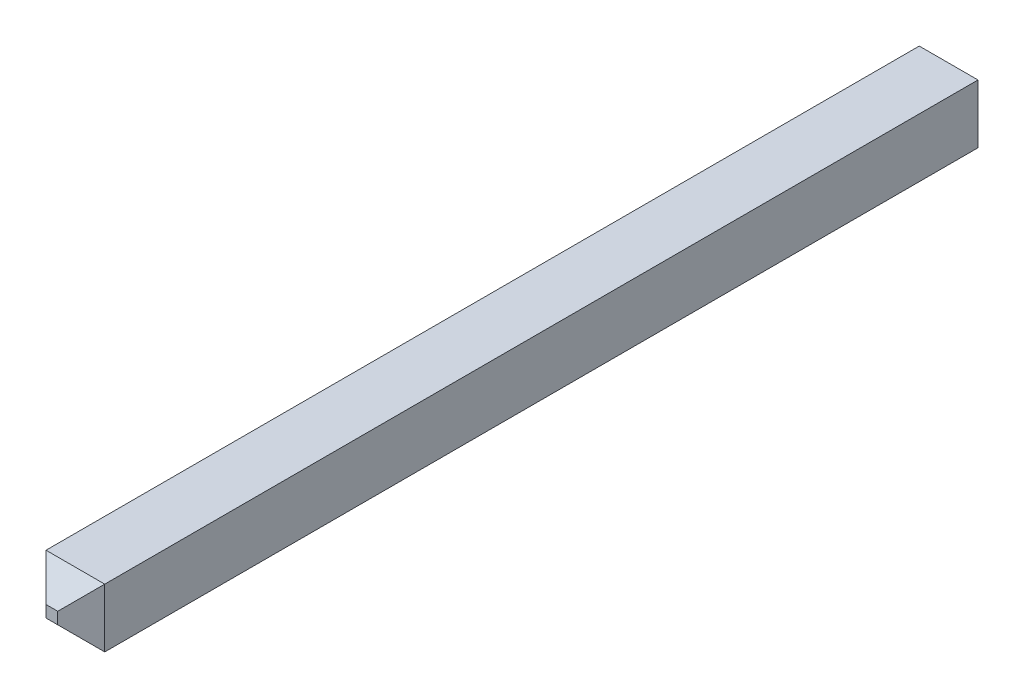
ISO-10303-21;
HEADER;
FILE_DESCRIPTION(('STEP AP214'),'2;1');
FILE_NAME('part.step','',(''),(''),'','','');
FILE_SCHEMA(('AUTOMOTIVE_DESIGN { 1 0 10303 214 1 1 1 1 }'));
ENDSEC;
DATA;
#1=APPLICATION_CONTEXT('core data for automotive mechanical design processes');
#2=APPLICATION_PROTOCOL_DEFINITION('international standard','automotive_design',2000,#1);
#3=PRODUCT_CONTEXT('',#1,'mechanical');
#4=PRODUCT('Part','Part','',(#3));
#5=PRODUCT_RELATED_PRODUCT_CATEGORY('part','',(#4));
#6=PRODUCT_DEFINITION_FORMATION('','',#4);
#7=PRODUCT_DEFINITION_CONTEXT('part definition',#1,'design');
#8=PRODUCT_DEFINITION('design','',#6,#7);
#9=PRODUCT_DEFINITION_SHAPE('','',#8);
#10=(LENGTH_UNIT() NAMED_UNIT(*) SI_UNIT(.MILLI.,.METRE.));
#11=(NAMED_UNIT(*) PLANE_ANGLE_UNIT() SI_UNIT($,.RADIAN.));
#12=(NAMED_UNIT(*) SI_UNIT($,.STERADIAN.) SOLID_ANGLE_UNIT());
#13=UNCERTAINTY_MEASURE_WITH_UNIT(LENGTH_MEASURE(1.E-05),#10,'distance_accuracy_value','');
#14=(GEOMETRIC_REPRESENTATION_CONTEXT(3) GLOBAL_UNCERTAINTY_ASSIGNED_CONTEXT((#13)) GLOBAL_UNIT_ASSIGNED_CONTEXT((#10,
#11,#12)) REPRESENTATION_CONTEXT('',''));
#15=CARTESIAN_POINT('',(0.,0.,0.));
#16=DIRECTION('',(0.,0.,1.));
#17=DIRECTION('',(1.,0.,0.));
#18=AXIS2_PLACEMENT_3D('',#15,#16,#17);
#19=CARTESIAN_POINT('',(0.631975872170932,-0.915257438330513,0.400189763779528));
#20=DIRECTION('',(0.,-0.707106781186544,-0.707106781186551));
#21=DIRECTION('',(0.,0.707106781186551,-0.707106781186544));
#22=AXIS2_PLACEMENT_3D('',#19,#20,#21);
#23=PLANE('',#22);
#24=DIRECTION('',(-1.,0.,0.));
#25=VECTOR('',#24,1.);
#26=CARTESIAN_POINT('',(0.612487683194554,-0.914666887149411,0.399599212598425));
#27=LINE('',#26,#25);
#28=CARTESIAN_POINT('',(0.612782958785105,-0.914666887149411,0.399599212598425));
#29=VERTEX_POINT('',#28);
#30=CARTESIAN_POINT('',(0.618688470596129,-0.914666887149411,0.399599212598425));
#31=VERTEX_POINT('',#30);
#32=EDGE_CURVE('E80',#29,#31,#27,.F.);
#33=ORIENTED_EDGE('',*,*,#32,.T.);
#34=DIRECTION('',(-0.577350269189636,-0.57735026918961,0.577350269189631));
#35=VECTOR('',#34,1.);
#36=CARTESIAN_POINT('',(0.630499494218177,-0.902855863527364,0.387788188976378));
#37=LINE('',#36,#35);
#38=CARTESIAN_POINT('',(0.630499494218177,-0.902855863527364,0.387788188976378));
#39=VERTEX_POINT('',#38);
#40=EDGE_CURVE('E20',#39,#31,#37,.T.);
#41=ORIENTED_EDGE('',*,*,#40,.F.);
#42=DIRECTION('',(1.,0.,0.));
#43=VECTOR('',#42,1.);
#44=CARTESIAN_POINT('',(0.599495557210302,-0.902855863527364,0.387788188976378));
#45=LINE('',#44,#43);
#46=CARTESIAN_POINT('',(0.600971935163058,-0.902855863527364,0.387788188976378));
#47=VERTEX_POINT('',#46);
#48=EDGE_CURVE('E107',#39,#47,#45,.F.);
#49=ORIENTED_EDGE('',*,*,#48,.T.);
#50=DIRECTION('',(-0.577350269189628,0.577350269189628,-0.577350269189622));
#51=VECTOR('',#50,1.);
#52=CARTESIAN_POINT('',(0.612782958785105,-0.914666887149411,0.399599212598425));
#53=LINE('',#52,#51);
#54=EDGE_CURVE('E86',#29,#47,#53,.T.);
#55=ORIENTED_EDGE('',*,*,#54,.F.);
#56=EDGE_LOOP('',(#33,#41,#49,#55));
#57=FACE_BOUND('',#56,.T.);
#58=ADVANCED_FACE('F17',(#57),#23,.F.);
#59=CARTESIAN_POINT('',(0.599495557210302,-0.902265312346261,-0.0505976377952755));
#60=DIRECTION('',(0.,0.707106781186552,-0.707106781186543));
#61=DIRECTION('',(0.,0.707106781186543,0.707106781186552));
#62=AXIS2_PLACEMENT_3D('',#59,#60,#61);
#63=PLANE('',#62);
#64=DIRECTION('',(-0.577350269189632,-0.577350269189605,-0.57735026918964));
#65=VECTOR('',#64,1.);
#66=CARTESIAN_POINT('',(0.630499494218177,-0.902855863527364,-0.0511881889763777));
#67=LINE('',#66,#65);
#68=CARTESIAN_POINT('',(0.630499494218177,-0.902855863527364,-0.051188188976378));
#69=VERTEX_POINT('',#68);
#70=CARTESIAN_POINT('',(0.618688470596129,-0.914666887149411,-0.0629992125984255));
#71=VERTEX_POINT('',#70);
#72=EDGE_CURVE('E109',#69,#71,#67,.T.);
#73=ORIENTED_EDGE('',*,*,#72,.T.);
#74=DIRECTION('',(-1.,0.,0.));
#75=VECTOR('',#74,1.);
#76=CARTESIAN_POINT('',(0.612487683194554,-0.914666887149411,-0.0629992125984253));
#77=LINE('',#76,#75);
#78=CARTESIAN_POINT('',(0.612782958785105,-0.914666887149411,-0.0629992125984253));
#79=VERTEX_POINT('',#78);
#80=EDGE_CURVE('E114',#79,#71,#77,.F.);
#81=ORIENTED_EDGE('',*,*,#80,.F.);
#82=DIRECTION('',(-0.577350269189626,0.57735026918962,0.577350269189631));
#83=VECTOR('',#82,1.);
#84=CARTESIAN_POINT('',(0.612782958785105,-0.914666887149411,-0.062999212598425));
#85=LINE('',#84,#83);
#86=CARTESIAN_POINT('',(0.600971935163058,-0.902855863527364,-0.051188188976378));
#87=VERTEX_POINT('',#86);
#88=EDGE_CURVE('E117',#79,#87,#85,.T.);
#89=ORIENTED_EDGE('',*,*,#88,.T.);
#90=DIRECTION('',(1.,0.,0.));
#91=VECTOR('',#90,1.);
#92=CARTESIAN_POINT('',(0.599495557210302,-0.902855863527364,-0.0511881889763779));
#93=LINE('',#92,#91);
#94=EDGE_CURVE('E105',#87,#69,#93,.T.);
#95=ORIENTED_EDGE('',*,*,#94,.T.);
#96=EDGE_LOOP('',(#73,#81,#89,#95));
#97=FACE_BOUND('',#96,.T.);
#98=ADVANCED_FACE('F175',(#97),#63,.T.);
#99=CARTESIAN_POINT('',(0.618097919415027,-0.901379485574608,0.400189763779528));
#100=DIRECTION('',(0.707106781186544,0.,0.707106781186551));
#101=DIRECTION('',(0.707106781186551,0.,-0.707106781186544));
#102=AXIS2_PLACEMENT_3D('',#99,#100,#101);
#103=PLANE('',#102);
#104=DIRECTION('',(0.,1.,0.));
#105=VECTOR('',#104,1.);
#106=CARTESIAN_POINT('',(0.630499494218177,-0.933859800535238,0.387788188976378));
#107=LINE('',#106,#105);
#108=CARTESIAN_POINT('',(0.630499494218177,-0.932383422582482,0.387788188976378));
#109=VERTEX_POINT('',#108);
#110=EDGE_CURVE('E94',#39,#109,#107,.F.);
#111=ORIENTED_EDGE('',*,*,#110,.F.);
#112=ORIENTED_EDGE('',*,*,#40,.T.);
#113=DIRECTION('',(0.,1.,0.));
#114=VECTOR('',#113,1.);
#115=CARTESIAN_POINT('',(0.618688470596129,-0.91437161155886,0.399599212598425));
#116=LINE('',#115,#114);
#117=CARTESIAN_POINT('',(0.618688470596129,-0.920572398960434,0.399599212598425));
#118=VERTEX_POINT('',#117);
#119=EDGE_CURVE('E88',#31,#118,#116,.F.);
#120=ORIENTED_EDGE('',*,*,#119,.T.);
#121=DIRECTION('',(-0.577350269189641,0.57735026918962,0.577350269189615));
#122=VECTOR('',#121,1.);
#123=CARTESIAN_POINT('',(0.630499494218177,-0.932383422582482,0.387788188976378));
#124=LINE('',#123,#122);
#125=EDGE_CURVE('E131',#109,#118,#124,.T.);
#126=ORIENTED_EDGE('',*,*,#125,.F.);
#127=EDGE_LOOP('',(#111,#112,#120,#126));
#128=FACE_BOUND('',#127,.T.);
#129=ADVANCED_FACE('F91',(#128),#103,.T.);
#130=CARTESIAN_POINT('',(0.612487683194554,-0.91437161155886,0.399599212598425));
#131=DIRECTION('',(0.,0.,-1.));
#132=DIRECTION('',(-1.,0.,0.));
#133=AXIS2_PLACEMENT_3D('',#130,#131,#132);
#134=PLANE('',#133);
#135=DIRECTION('',(1.,0.,0.));
#136=VECTOR('',#135,1.);
#137=CARTESIAN_POINT('',(0.631975872170932,-0.920572398960435,0.399599212598426));
#138=LINE('',#137,#136);
#139=CARTESIAN_POINT('',(0.612782958785105,-0.920572398960434,0.399599212598425));
#140=VERTEX_POINT('',#139);
#141=EDGE_CURVE('E98',#118,#140,#138,.F.);
#142=ORIENTED_EDGE('',*,*,#141,.F.);
#143=ORIENTED_EDGE('',*,*,#119,.F.);
#144=ORIENTED_EDGE('',*,*,#32,.F.);
#145=DIRECTION('',(0.,1.,0.));
#146=VECTOR('',#145,1.);
#147=CARTESIAN_POINT('',(0.612782958785105,-0.933859800535238,0.399599212598425));
#148=LINE('',#147,#146);
#149=EDGE_CURVE('E100',#140,#29,#148,.T.);
#150=ORIENTED_EDGE('',*,*,#149,.F.);
#151=EDGE_LOOP('',(#142,#143,#144,#150));
#152=FACE_BOUND('',#151,.T.);
#153=ADVANCED_FACE('F96',(#152),#134,.F.);
#154=CARTESIAN_POINT('',(0.613373509966208,-0.933859800535238,0.400189763779528));
#155=DIRECTION('',(-0.707106781186544,0.,0.707106781186551));
#156=DIRECTION('',(0.707106781186551,0.,0.707106781186544));
#157=AXIS2_PLACEMENT_3D('',#154,#155,#156);
#158=PLANE('',#157);
#159=ORIENTED_EDGE('',*,*,#149,.T.);
#160=ORIENTED_EDGE('',*,*,#54,.T.);
#161=DIRECTION('',(0.,1.,0.));
#162=VECTOR('',#161,1.);
#163=CARTESIAN_POINT('',(0.600971935163058,-0.901379485574608,0.387788188976378));
#164=LINE('',#163,#162);
#165=CARTESIAN_POINT('',(0.600971935163058,-0.932383422582482,0.387788188976378));
#166=VERTEX_POINT('',#165);
#167=EDGE_CURVE('E134',#166,#47,#164,.T.);
#168=ORIENTED_EDGE('',*,*,#167,.F.);
#169=DIRECTION('',(-0.577350269189606,-0.577350269189638,-0.577350269189633));
#170=VECTOR('',#169,1.);
#171=CARTESIAN_POINT('',(0.612782958785105,-0.920572398960435,0.399599212598426));
#172=LINE('',#171,#170);
#173=EDGE_CURVE('E128',#140,#166,#172,.T.);
#174=ORIENTED_EDGE('',*,*,#173,.F.);
#175=EDGE_LOOP('',(#159,#160,#168,#174));
#176=FACE_BOUND('',#175,.T.);
#177=ADVANCED_FACE('F184',(#176),#158,.T.);
#178=CARTESIAN_POINT('',(0.599495557210302,-0.902855863527364,0.152158267716535));
#179=DIRECTION('',(0.,-1.,0.));
#180=DIRECTION('',(0.,0.,-1.));
#181=AXIS2_PLACEMENT_3D('',#178,#179,#180);
#182=PLANE('',#181);
#183=ORIENTED_EDGE('',*,*,#48,.F.);
#184=DIRECTION('',(0.,0.,-1.));
#185=VECTOR('',#184,1.);
#186=CARTESIAN_POINT('',(0.630499494218177,-0.902855863527364,0.152158267716535));
#187=LINE('',#186,#185);
#188=EDGE_CURVE('E122',#69,#39,#187,.F.);
#189=ORIENTED_EDGE('',*,*,#188,.F.);
#190=ORIENTED_EDGE('',*,*,#94,.F.);
#191=DIRECTION('',(0.,0.,1.));
#192=VECTOR('',#191,1.);
#193=CARTESIAN_POINT('',(0.600971935163058,-0.902855863527364,0.152158267716535));
#194=LINE('',#193,#192);
#195=EDGE_CURVE('E137',#47,#87,#194,.F.);
#196=ORIENTED_EDGE('',*,*,#195,.F.);
#197=EDGE_LOOP('',(#183,#189,#190,#196));
#198=FACE_BOUND('',#197,.T.);
#199=ADVANCED_FACE('F186',(#198),#182,.F.);
#200=CARTESIAN_POINT('',(0.631090045399279,-0.933859800535238,-0.0505976377952755));
#201=DIRECTION('',(-0.707106781186552,0.,0.707106781186543));
#202=DIRECTION('',(0.707106781186543,0.,0.707106781186552));
#203=AXIS2_PLACEMENT_3D('',#200,#201,#202);
#204=PLANE('',#203);
#205=DIRECTION('',(-0.577350269189637,0.577350269189616,-0.577350269189624));
#206=VECTOR('',#205,1.);
#207=CARTESIAN_POINT('',(0.630499494218177,-0.932383422582482,-0.0511881889763777));
#208=LINE('',#207,#206);
#209=CARTESIAN_POINT('',(0.630499494218177,-0.932383422582482,-0.0511881889763778));
#210=VERTEX_POINT('',#209);
#211=CARTESIAN_POINT('',(0.618688470596129,-0.920572398960434,-0.0629992125984255));
#212=VERTEX_POINT('',#211);
#213=EDGE_CURVE('E142',#210,#212,#208,.T.);
#214=ORIENTED_EDGE('',*,*,#213,.T.);
#215=DIRECTION('',(0.,1.,0.));
#216=VECTOR('',#215,1.);
#217=CARTESIAN_POINT('',(0.618688470596129,-0.91437161155886,-0.0629992125984253));
#218=LINE('',#217,#216);
#219=EDGE_CURVE('E111',#71,#212,#218,.F.);
#220=ORIENTED_EDGE('',*,*,#219,.F.);
#221=ORIENTED_EDGE('',*,*,#72,.F.);
#222=DIRECTION('',(0.,1.,0.));
#223=VECTOR('',#222,1.);
#224=CARTESIAN_POINT('',(0.630499494218177,-0.933859800535238,-0.0511881889763779));
#225=LINE('',#224,#223);
#226=EDGE_CURVE('E125',#210,#69,#225,.T.);
#227=ORIENTED_EDGE('',*,*,#226,.F.);
#228=EDGE_LOOP('',(#214,#220,#221,#227));
#229=FACE_BOUND('',#228,.T.);
#230=ADVANCED_FACE('F169',(#229),#204,.F.);
#231=CARTESIAN_POINT('',(0.612487683194554,-0.91437161155886,-0.0629992125984253));
#232=DIRECTION('',(0.,0.,-1.));
#233=DIRECTION('',(-1.,0.,0.));
#234=AXIS2_PLACEMENT_3D('',#231,#232,#233);
#235=PLANE('',#234);
#236=DIRECTION('',(0.,1.,0.));
#237=VECTOR('',#236,1.);
#238=CARTESIAN_POINT('',(0.612782958785105,-0.901379485574608,-0.062999212598425));
#239=LINE('',#238,#237);
#240=CARTESIAN_POINT('',(0.612782958785105,-0.920572398960434,-0.0629992125984253));
#241=VERTEX_POINT('',#240);
#242=EDGE_CURVE('E119',#241,#79,#239,.T.);
#243=ORIENTED_EDGE('',*,*,#242,.T.);
#244=ORIENTED_EDGE('',*,*,#80,.T.);
#245=ORIENTED_EDGE('',*,*,#219,.T.);
#246=DIRECTION('',(1.,0.,0.));
#247=VECTOR('',#246,1.);
#248=CARTESIAN_POINT('',(0.599495557210302,-0.920572398960434,-0.0629992125984255));
#249=LINE('',#248,#247);
#250=EDGE_CURVE('E144',#212,#241,#249,.F.);
#251=ORIENTED_EDGE('',*,*,#250,.T.);
#252=EDGE_LOOP('',(#243,#244,#245,#251));
#253=FACE_BOUND('',#252,.T.);
#254=ADVANCED_FACE('F173',(#253),#235,.T.);
#255=CARTESIAN_POINT('',(0.600381383981956,-0.901379485574608,-0.0505976377952755));
#256=DIRECTION('',(0.707106781186552,0.,0.707106781186543));
#257=DIRECTION('',(0.707106781186543,0.,-0.707106781186552));
#258=AXIS2_PLACEMENT_3D('',#255,#256,#257);
#259=PLANE('',#258);
#260=DIRECTION('',(-0.577350269189602,-0.577350269189634,0.577350269189642));
#261=VECTOR('',#260,1.);
#262=CARTESIAN_POINT('',(0.612782958785105,-0.920572398960434,-0.0629992125984255));
#263=LINE('',#262,#261);
#264=CARTESIAN_POINT('',(0.600971935163058,-0.932383422582482,-0.0511881889763778));
#265=VERTEX_POINT('',#264);
#266=EDGE_CURVE('E35',#241,#265,#263,.T.);
#267=ORIENTED_EDGE('',*,*,#266,.T.);
#268=DIRECTION('',(0.,1.,0.));
#269=VECTOR('',#268,1.);
#270=CARTESIAN_POINT('',(0.600971935163058,-0.901379485574608,-0.0511881889763779));
#271=LINE('',#270,#269);
#272=EDGE_CURVE('E140',#87,#265,#271,.F.);
#273=ORIENTED_EDGE('',*,*,#272,.F.);
#274=ORIENTED_EDGE('',*,*,#88,.F.);
#275=ORIENTED_EDGE('',*,*,#242,.F.);
#276=EDGE_LOOP('',(#267,#273,#274,#275));
#277=FACE_BOUND('',#276,.T.);
#278=ADVANCED_FACE('F209',(#277),#259,.F.);
#279=CARTESIAN_POINT('',(0.630499494218177,-0.933859800535238,0.152158267716535));
#280=DIRECTION('',(1.,0.,0.));
#281=DIRECTION('',(0.,0.,-1.));
#282=AXIS2_PLACEMENT_3D('',#279,#280,#281);
#283=PLANE('',#282);
#284=DIRECTION('',(0.,0.,-1.));
#285=VECTOR('',#284,1.);
#286=CARTESIAN_POINT('',(0.630499494218177,-0.932383422582482,0.152158267716535));
#287=LINE('',#286,#285);
#288=EDGE_CURVE('E147',#210,#109,#287,.F.);
#289=ORIENTED_EDGE('',*,*,#288,.F.);
#290=ORIENTED_EDGE('',*,*,#226,.T.);
#291=ORIENTED_EDGE('',*,*,#188,.T.);
#292=ORIENTED_EDGE('',*,*,#110,.T.);
#293=EDGE_LOOP('',(#289,#290,#291,#292));
#294=FACE_BOUND('',#293,.T.);
#295=ADVANCED_FACE('F179',(#294),#283,.T.);
#296=CARTESIAN_POINT('',(0.631975872170932,-0.919981847779332,0.400189763779528));
#297=DIRECTION('',(0.,-0.707106781186544,0.707106781186551));
#298=DIRECTION('',(0.,-0.707106781186551,-0.707106781186544));
#299=AXIS2_PLACEMENT_3D('',#296,#297,#298);
#300=PLANE('',#299);
#301=ORIENTED_EDGE('',*,*,#125,.T.);
#302=ORIENTED_EDGE('',*,*,#141,.T.);
#303=ORIENTED_EDGE('',*,*,#173,.T.);
#304=DIRECTION('',(1.,0.,0.));
#305=VECTOR('',#304,1.);
#306=CARTESIAN_POINT('',(0.599495557210302,-0.932383422582482,0.387788188976378));
#307=LINE('',#306,#305);
#308=EDGE_CURVE('E150',#109,#166,#307,.F.);
#309=ORIENTED_EDGE('',*,*,#308,.F.);
#310=EDGE_LOOP('',(#301,#302,#303,#309));
#311=FACE_BOUND('',#310,.T.);
#312=ADVANCED_FACE('F181',(#311),#300,.T.);
#313=CARTESIAN_POINT('',(0.600971935163058,-0.901379485574608,0.152158267716535));
#314=DIRECTION('',(-1.,0.,0.));
#315=DIRECTION('',(0.,0.,1.));
#316=AXIS2_PLACEMENT_3D('',#313,#314,#315);
#317=PLANE('',#316);
#318=ORIENTED_EDGE('',*,*,#195,.T.);
#319=ORIENTED_EDGE('',*,*,#272,.T.);
#320=DIRECTION('',(0.,0.,-1.));
#321=VECTOR('',#320,1.);
#322=CARTESIAN_POINT('',(0.600971935163058,-0.932383422582482,0.152158267716535));
#323=LINE('',#322,#321);
#324=EDGE_CURVE('E26',#166,#265,#323,.T.);
#325=ORIENTED_EDGE('',*,*,#324,.F.);
#326=ORIENTED_EDGE('',*,*,#167,.T.);
#327=EDGE_LOOP('',(#318,#319,#325,#326));
#328=FACE_BOUND('',#327,.T.);
#329=ADVANCED_FACE('F160',(#328),#317,.T.);
#330=CARTESIAN_POINT('',(0.599495557210302,-0.932973973763584,-0.0505976377952755));
#331=DIRECTION('',(0.,0.707106781186552,0.707106781186543));
#332=DIRECTION('',(0.,-0.707106781186543,0.707106781186552));
#333=AXIS2_PLACEMENT_3D('',#330,#331,#332);
#334=PLANE('',#333);
#335=ORIENTED_EDGE('',*,*,#250,.F.);
#336=ORIENTED_EDGE('',*,*,#213,.F.);
#337=DIRECTION('',(1.,0.,0.));
#338=VECTOR('',#337,1.);
#339=CARTESIAN_POINT('',(0.599495557210302,-0.932383422582482,-0.0511881889763779));
#340=LINE('',#339,#338);
#341=EDGE_CURVE('E11',#265,#210,#340,.T.);
#342=ORIENTED_EDGE('',*,*,#341,.F.);
#343=ORIENTED_EDGE('',*,*,#266,.F.);
#344=EDGE_LOOP('',(#335,#336,#342,#343));
#345=FACE_BOUND('',#344,.T.);
#346=ADVANCED_FACE('F166',(#345),#334,.F.);
#347=CARTESIAN_POINT('',(0.599495557210302,-0.932383422582482,0.152158267716535));
#348=DIRECTION('',(0.,-1.,0.));
#349=DIRECTION('',(0.,0.,-1.));
#350=AXIS2_PLACEMENT_3D('',#347,#348,#349);
#351=PLANE('',#350);
#352=ORIENTED_EDGE('',*,*,#324,.T.);
#353=ORIENTED_EDGE('',*,*,#341,.T.);
#354=ORIENTED_EDGE('',*,*,#288,.T.);
#355=ORIENTED_EDGE('',*,*,#308,.T.);
#356=EDGE_LOOP('',(#352,#353,#354,#355));
#357=FACE_BOUND('',#356,.T.);
#358=ADVANCED_FACE('F156',(#357),#351,.T.);
#359=CLOSED_SHELL('',(#58,#98,#129,#153,#177,#199,#230,#254,#278,#295,#312,#329,#346,#358));
#360=MANIFOLD_SOLID_BREP('B1',#359);
#361=ADVANCED_BREP_SHAPE_REPRESENTATION('',(#18,#360),#14);
#362=SHAPE_DEFINITION_REPRESENTATION(#9,#361);
ENDSEC;
END-ISO-10303-21;
